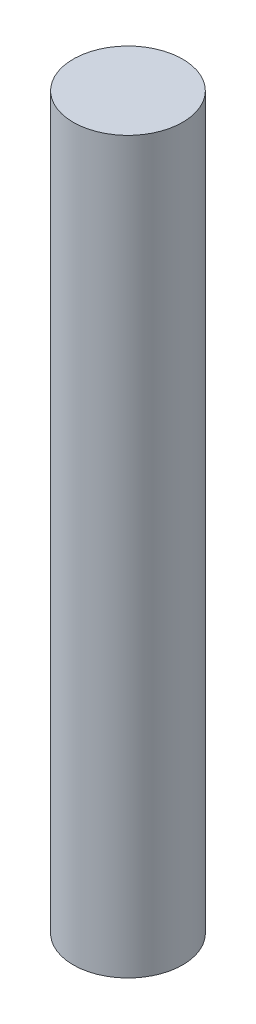
ISO-10303-21;
HEADER;
FILE_DESCRIPTION(('STEP AP214'),'2;1');
FILE_NAME('part.step','',(''),(''),'','','');
FILE_SCHEMA(('AUTOMOTIVE_DESIGN { 1 0 10303 214 1 1 1 1 }'));
ENDSEC;
DATA;
#1=APPLICATION_CONTEXT('core data for automotive mechanical design processes');
#2=APPLICATION_PROTOCOL_DEFINITION('international standard','automotive_design',2000,#1);
#3=PRODUCT_CONTEXT('',#1,'mechanical');
#4=PRODUCT('Part','Part','',(#3));
#5=PRODUCT_RELATED_PRODUCT_CATEGORY('part','',(#4));
#6=PRODUCT_DEFINITION_FORMATION('','',#4);
#7=PRODUCT_DEFINITION_CONTEXT('part definition',#1,'design');
#8=PRODUCT_DEFINITION('design','',#6,#7);
#9=PRODUCT_DEFINITION_SHAPE('','',#8);
#10=(LENGTH_UNIT() NAMED_UNIT(*) SI_UNIT(.MILLI.,.METRE.));
#11=(NAMED_UNIT(*) PLANE_ANGLE_UNIT() SI_UNIT($,.RADIAN.));
#12=(NAMED_UNIT(*) SI_UNIT($,.STERADIAN.) SOLID_ANGLE_UNIT());
#13=UNCERTAINTY_MEASURE_WITH_UNIT(LENGTH_MEASURE(1.E-05),#10,'distance_accuracy_value','');
#14=(GEOMETRIC_REPRESENTATION_CONTEXT(3) GLOBAL_UNCERTAINTY_ASSIGNED_CONTEXT((#13)) GLOBAL_UNIT_ASSIGNED_CONTEXT((#10,
#11,#12)) REPRESENTATION_CONTEXT('',''));
#15=CARTESIAN_POINT('',(0.,0.,0.));
#16=DIRECTION('',(0.,0.,1.));
#17=DIRECTION('',(1.,0.,0.));
#18=AXIS2_PLACEMENT_3D('',#15,#16,#17);
#19=CARTESIAN_POINT('',(0.,200.,0.));
#20=DIRECTION('',(0.,-1.,0.));
#21=DIRECTION('',(0.,0.,-1.));
#22=AXIS2_PLACEMENT_3D('',#19,#20,#21);
#23=CYLINDRICAL_SURFACE('',#22,15.);
#24=CARTESIAN_POINT('',(0.,200.,0.));
#25=DIRECTION('',(0.,1.,0.));
#26=DIRECTION('',(0.,0.,1.));
#27=AXIS2_PLACEMENT_3D('',#24,#25,#26);
#28=CIRCLE('',#27,15.);
#29=CARTESIAN_POINT('',(0.,200.,15.));
#30=VERTEX_POINT('',#29);
#31=EDGE_CURVE('E10',#30,#30,#28,.T.);
#32=ORIENTED_EDGE('',*,*,#31,.F.);
#33=EDGE_LOOP('',(#32));
#34=FACE_BOUND('',#33,.T.);
#35=CARTESIAN_POINT('',(0.,0.,0.));
#36=DIRECTION('',(0.,1.,0.));
#37=DIRECTION('',(0.,0.,1.));
#38=AXIS2_PLACEMENT_3D('',#35,#36,#37);
#39=CIRCLE('',#38,15.);
#40=CARTESIAN_POINT('',(0.,0.,15.));
#41=VERTEX_POINT('',#40);
#42=EDGE_CURVE('E40',#41,#41,#39,.T.);
#43=ORIENTED_EDGE('',*,*,#42,.T.);
#44=EDGE_LOOP('',(#43));
#45=FACE_BOUND('',#44,.T.);
#46=ADVANCED_FACE('F37',(#34,#45),#23,.T.);
#47=CARTESIAN_POINT('',(0.,200.,0.));
#48=DIRECTION('',(0.,1.,0.));
#49=DIRECTION('',(0.,0.,1.));
#50=AXIS2_PLACEMENT_3D('',#47,#48,#49);
#51=PLANE('',#50);
#52=ORIENTED_EDGE('',*,*,#31,.T.);
#53=EDGE_LOOP('',(#52));
#54=FACE_BOUND('',#53,.T.);
#55=ADVANCED_FACE('F54',(#54),#51,.T.);
#56=CARTESIAN_POINT('',(0.,0.,0.));
#57=DIRECTION('',(0.,1.,0.));
#58=DIRECTION('',(0.,0.,1.));
#59=AXIS2_PLACEMENT_3D('',#56,#57,#58);
#60=PLANE('',#59);
#61=ORIENTED_EDGE('',*,*,#42,.F.);
#62=EDGE_LOOP('',(#61));
#63=FACE_BOUND('',#62,.T.);
#64=ADVANCED_FACE('F52',(#63),#60,.F.);
#65=CLOSED_SHELL('',(#46,#55,#64));
#66=MANIFOLD_SOLID_BREP('B2',#65);
#67=ADVANCED_BREP_SHAPE_REPRESENTATION('',(#18,#66),#14);
#68=SHAPE_DEFINITION_REPRESENTATION(#9,#67);
ENDSEC;
END-ISO-10303-21;
